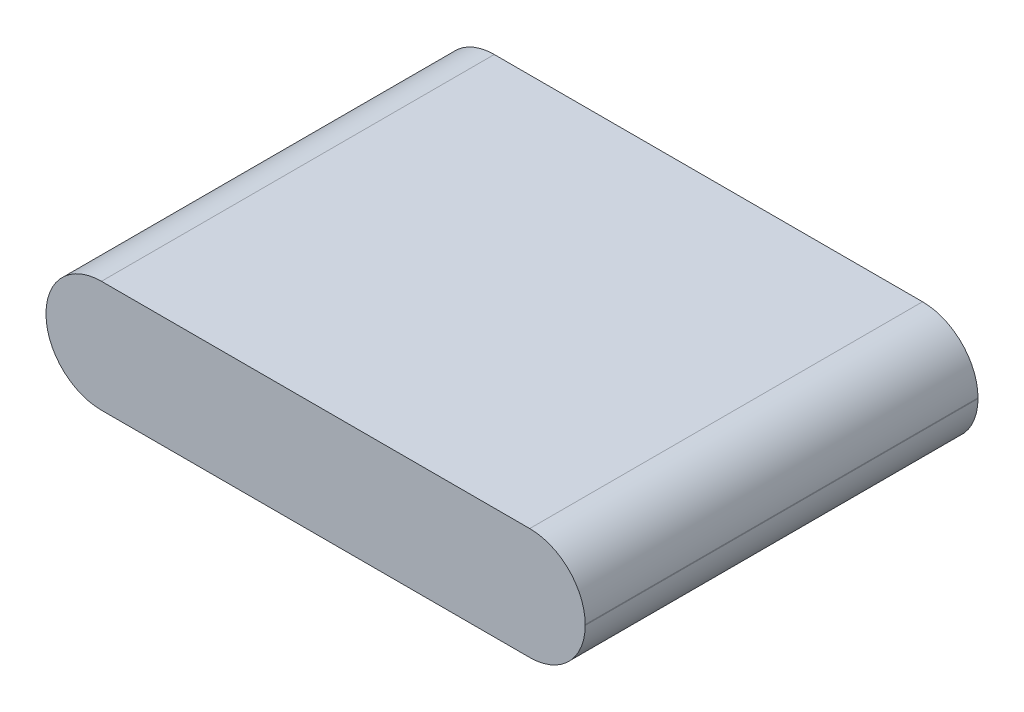
ISO-10303-21;
HEADER;
FILE_DESCRIPTION(('STEP AP214'),'2;1');
FILE_NAME('part.step','',(''),(''),'','','');
FILE_SCHEMA(('AUTOMOTIVE_DESIGN { 1 0 10303 214 1 1 1 1 }'));
ENDSEC;
DATA;
#1=APPLICATION_CONTEXT('core data for automotive mechanical design processes');
#2=APPLICATION_PROTOCOL_DEFINITION('international standard','automotive_design',2000,#1);
#3=PRODUCT_CONTEXT('',#1,'mechanical');
#4=PRODUCT('Part','Part','',(#3));
#5=PRODUCT_RELATED_PRODUCT_CATEGORY('part','',(#4));
#6=PRODUCT_DEFINITION_FORMATION('','',#4);
#7=PRODUCT_DEFINITION_CONTEXT('part definition',#1,'design');
#8=PRODUCT_DEFINITION('design','',#6,#7);
#9=PRODUCT_DEFINITION_SHAPE('','',#8);
#10=(LENGTH_UNIT() NAMED_UNIT(*) SI_UNIT(.MILLI.,.METRE.));
#11=(NAMED_UNIT(*) PLANE_ANGLE_UNIT() SI_UNIT($,.RADIAN.));
#12=(NAMED_UNIT(*) SI_UNIT($,.STERADIAN.) SOLID_ANGLE_UNIT());
#13=UNCERTAINTY_MEASURE_WITH_UNIT(LENGTH_MEASURE(1.E-05),#10,'distance_accuracy_value','');
#14=(GEOMETRIC_REPRESENTATION_CONTEXT(3) GLOBAL_UNCERTAINTY_ASSIGNED_CONTEXT((#13)) GLOBAL_UNIT_ASSIGNED_CONTEXT((#10,
#11,#12)) REPRESENTATION_CONTEXT('',''));
#15=CARTESIAN_POINT('',(0.,0.,0.));
#16=DIRECTION('',(0.,0.,1.));
#17=DIRECTION('',(1.,0.,0.));
#18=AXIS2_PLACEMENT_3D('',#15,#16,#17);
#19=CARTESIAN_POINT('',(35.,14.5,25.5));
#20=DIRECTION('',(-1.,0.,0.));
#21=DIRECTION('',(0.,0.,1.));
#22=AXIS2_PLACEMENT_3D('',#19,#20,#21);
#23=PLANE('',#22);
#24=DIRECTION('',(0.,-1.,0.));
#25=VECTOR('',#24,1.);
#26=CARTESIAN_POINT('',(35.,14.5,25.5));
#27=LINE('',#26,#25);
#28=CARTESIAN_POINT('',(35.,7.3,25.5));
#29=VERTEX_POINT('',#28);
#30=CARTESIAN_POINT('',(35.,7.2,25.5));
#31=VERTEX_POINT('',#30);
#32=EDGE_CURVE('E133',#29,#31,#27,.T.);
#33=ORIENTED_EDGE('',*,*,#32,.T.);
#34=DIRECTION('',(0.,0.,-1.));
#35=VECTOR('',#34,1.);
#36=CARTESIAN_POINT('',(35.,7.2,-25.5));
#37=LINE('',#36,#35);
#38=CARTESIAN_POINT('',(35.,7.2,-25.5));
#39=VERTEX_POINT('',#38);
#40=EDGE_CURVE('E11',#31,#39,#37,.T.);
#41=ORIENTED_EDGE('',*,*,#40,.T.);
#42=DIRECTION('',(0.,-1.,0.));
#43=VECTOR('',#42,1.);
#44=CARTESIAN_POINT('',(35.,14.5,-25.5));
#45=LINE('',#44,#43);
#46=CARTESIAN_POINT('',(35.,7.3,-25.5));
#47=VERTEX_POINT('',#46);
#48=EDGE_CURVE('E138',#47,#39,#45,.T.);
#49=ORIENTED_EDGE('',*,*,#48,.F.);
#50=DIRECTION('',(0.,0.,-1.));
#51=VECTOR('',#50,1.);
#52=CARTESIAN_POINT('',(35.,7.3,25.5));
#53=LINE('',#52,#51);
#54=EDGE_CURVE('E53',#47,#29,#53,.F.);
#55=ORIENTED_EDGE('',*,*,#54,.T.);
#56=EDGE_LOOP('',(#33,#41,#49,#55));
#57=FACE_BOUND('',#56,.T.);
#58=ADVANCED_FACE('F45',(#57),#23,.F.);
#59=CARTESIAN_POINT('',(-35.,14.5,-25.5));
#60=DIRECTION('',(0.,0.,1.));
#61=DIRECTION('',(1.,0.,0.));
#62=AXIS2_PLACEMENT_3D('',#59,#60,#61);
#63=PLANE('',#62);
#64=DIRECTION('',(-1.,0.,0.));
#65=VECTOR('',#64,1.);
#66=CARTESIAN_POINT('',(-35.,0.,-25.5));
#67=LINE('',#66,#65);
#68=CARTESIAN_POINT('',(27.8,0.,-25.5));
#69=VERTEX_POINT('',#68);
#70=CARTESIAN_POINT('',(-27.8,0.,-25.5));
#71=VERTEX_POINT('',#70);
#72=EDGE_CURVE('E180',#69,#71,#67,.T.);
#73=ORIENTED_EDGE('',*,*,#72,.T.);
#74=CARTESIAN_POINT('',(-27.8,7.2,-25.5));
#75=DIRECTION('',(0.,0.,1.));
#76=DIRECTION('',(1.,0.,0.));
#77=AXIS2_PLACEMENT_3D('',#74,#75,#76);
#78=CIRCLE('',#77,7.2);
#79=CARTESIAN_POINT('',(-35.,7.2,-25.5));
#80=VERTEX_POINT('',#79);
#81=EDGE_CURVE('E155',#71,#80,#78,.F.);
#82=ORIENTED_EDGE('',*,*,#81,.T.);
#83=DIRECTION('',(0.,-1.,0.));
#84=VECTOR('',#83,1.);
#85=CARTESIAN_POINT('',(-35.,14.5,-25.5));
#86=LINE('',#85,#84);
#87=CARTESIAN_POINT('',(-35.,7.3,-25.5));
#88=VERTEX_POINT('',#87);
#89=EDGE_CURVE('E132',#88,#80,#86,.T.);
#90=ORIENTED_EDGE('',*,*,#89,.F.);
#91=CARTESIAN_POINT('',(-27.8,7.3,-25.5));
#92=DIRECTION('',(0.,0.,1.));
#93=DIRECTION('',(1.,0.,0.));
#94=AXIS2_PLACEMENT_3D('',#91,#92,#93);
#95=CIRCLE('',#94,7.2);
#96=CARTESIAN_POINT('',(-27.8,14.5,-25.5));
#97=VERTEX_POINT('',#96);
#98=EDGE_CURVE('E137',#88,#97,#95,.F.);
#99=ORIENTED_EDGE('',*,*,#98,.T.);
#100=DIRECTION('',(-1.,0.,0.));
#101=VECTOR('',#100,1.);
#102=CARTESIAN_POINT('',(-35.,14.5,-25.5));
#103=LINE('',#102,#101);
#104=CARTESIAN_POINT('',(27.8,14.5,-25.5));
#105=VERTEX_POINT('',#104);
#106=EDGE_CURVE('E174',#105,#97,#103,.T.);
#107=ORIENTED_EDGE('',*,*,#106,.F.);
#108=CARTESIAN_POINT('',(27.8,7.3,-25.5));
#109=DIRECTION('',(0.,0.,1.));
#110=DIRECTION('',(1.,0.,0.));
#111=AXIS2_PLACEMENT_3D('',#108,#109,#110);
#112=CIRCLE('',#111,7.2);
#113=EDGE_CURVE('E67',#105,#47,#112,.F.);
#114=ORIENTED_EDGE('',*,*,#113,.T.);
#115=ORIENTED_EDGE('',*,*,#48,.T.);
#116=CARTESIAN_POINT('',(27.8,7.2,-25.5));
#117=DIRECTION('',(0.,0.,1.));
#118=DIRECTION('',(1.,0.,0.));
#119=AXIS2_PLACEMENT_3D('',#116,#117,#118);
#120=CIRCLE('',#119,7.2);
#121=EDGE_CURVE('E60',#39,#69,#120,.F.);
#122=ORIENTED_EDGE('',*,*,#121,.T.);
#123=EDGE_LOOP('',(#73,#82,#90,#99,#107,#114,#115,#122));
#124=FACE_BOUND('',#123,.T.);
#125=ADVANCED_FACE('F176',(#124),#63,.F.);
#126=CARTESIAN_POINT('',(-35.,14.5,25.5));
#127=DIRECTION('',(1.,0.,0.));
#128=DIRECTION('',(0.,0.,-1.));
#129=AXIS2_PLACEMENT_3D('',#126,#127,#128);
#130=PLANE('',#129);
#131=ORIENTED_EDGE('',*,*,#89,.T.);
#132=DIRECTION('',(0.,0.,1.));
#133=VECTOR('',#132,1.);
#134=CARTESIAN_POINT('',(-35.,7.2,25.5));
#135=LINE('',#134,#133);
#136=CARTESIAN_POINT('',(-35.,7.2,25.5));
#137=VERTEX_POINT('',#136);
#138=EDGE_CURVE('E131',#80,#137,#135,.T.);
#139=ORIENTED_EDGE('',*,*,#138,.T.);
#140=DIRECTION('',(0.,-1.,0.));
#141=VECTOR('',#140,1.);
#142=CARTESIAN_POINT('',(-35.,14.5,25.5));
#143=LINE('',#142,#141);
#144=CARTESIAN_POINT('',(-35.,7.3,25.5));
#145=VERTEX_POINT('',#144);
#146=EDGE_CURVE('E114',#145,#137,#143,.T.);
#147=ORIENTED_EDGE('',*,*,#146,.F.);
#148=DIRECTION('',(0.,0.,1.));
#149=VECTOR('',#148,1.);
#150=CARTESIAN_POINT('',(-35.,7.3,25.5));
#151=LINE('',#150,#149);
#152=EDGE_CURVE('E128',#145,#88,#151,.F.);
#153=ORIENTED_EDGE('',*,*,#152,.T.);
#154=EDGE_LOOP('',(#131,#139,#147,#153));
#155=FACE_BOUND('',#154,.T.);
#156=ADVANCED_FACE('F127',(#155),#130,.F.);
#157=CARTESIAN_POINT('',(-35.,14.5,25.5));
#158=DIRECTION('',(0.,0.,-1.));
#159=DIRECTION('',(-1.,0.,0.));
#160=AXIS2_PLACEMENT_3D('',#157,#158,#159);
#161=PLANE('',#160);
#162=ORIENTED_EDGE('',*,*,#146,.T.);
#163=CARTESIAN_POINT('',(-27.8,7.2,25.5));
#164=DIRECTION('',(0.,0.,-1.));
#165=DIRECTION('',(-1.,0.,0.));
#166=AXIS2_PLACEMENT_3D('',#163,#164,#165);
#167=CIRCLE('',#166,7.2);
#168=CARTESIAN_POINT('',(-27.8,0.,25.5));
#169=VERTEX_POINT('',#168);
#170=EDGE_CURVE('E121',#137,#169,#167,.F.);
#171=ORIENTED_EDGE('',*,*,#170,.T.);
#172=DIRECTION('',(1.,0.,0.));
#173=VECTOR('',#172,1.);
#174=CARTESIAN_POINT('',(-35.,0.,25.5));
#175=LINE('',#174,#173);
#176=CARTESIAN_POINT('',(27.8,0.,25.5));
#177=VERTEX_POINT('',#176);
#178=EDGE_CURVE('E177',#169,#177,#175,.T.);
#179=ORIENTED_EDGE('',*,*,#178,.T.);
#180=CARTESIAN_POINT('',(27.8,7.2,25.5));
#181=DIRECTION('',(0.,0.,-1.));
#182=DIRECTION('',(-1.,0.,0.));
#183=AXIS2_PLACEMENT_3D('',#180,#181,#182);
#184=CIRCLE('',#183,7.2);
#185=EDGE_CURVE('E122',#177,#31,#184,.F.);
#186=ORIENTED_EDGE('',*,*,#185,.T.);
#187=ORIENTED_EDGE('',*,*,#32,.F.);
#188=CARTESIAN_POINT('',(27.8,7.3,25.5));
#189=DIRECTION('',(0.,0.,-1.));
#190=DIRECTION('',(-1.,0.,0.));
#191=AXIS2_PLACEMENT_3D('',#188,#189,#190);
#192=CIRCLE('',#191,7.2);
#193=CARTESIAN_POINT('',(27.8,14.5,25.5));
#194=VERTEX_POINT('',#193);
#195=EDGE_CURVE('E140',#29,#194,#192,.F.);
#196=ORIENTED_EDGE('',*,*,#195,.T.);
#197=DIRECTION('',(1.,0.,0.));
#198=VECTOR('',#197,1.);
#199=CARTESIAN_POINT('',(-35.,14.5,25.5));
#200=LINE('',#199,#198);
#201=CARTESIAN_POINT('',(-27.8,14.5,25.5));
#202=VERTEX_POINT('',#201);
#203=EDGE_CURVE('E116',#202,#194,#200,.T.);
#204=ORIENTED_EDGE('',*,*,#203,.F.);
#205=CARTESIAN_POINT('',(-27.8,7.3,25.5));
#206=DIRECTION('',(0.,0.,-1.));
#207=DIRECTION('',(-1.,0.,0.));
#208=AXIS2_PLACEMENT_3D('',#205,#206,#207);
#209=CIRCLE('',#208,7.2);
#210=EDGE_CURVE('E111',#202,#145,#209,.F.);
#211=ORIENTED_EDGE('',*,*,#210,.T.);
#212=EDGE_LOOP('',(#162,#171,#179,#186,#187,#196,#204,#211));
#213=FACE_BOUND('',#212,.T.);
#214=ADVANCED_FACE('F113',(#213),#161,.F.);
#215=CARTESIAN_POINT('',(0.,14.5,0.));
#216=DIRECTION('',(0.,-1.,0.));
#217=DIRECTION('',(0.,0.,-1.));
#218=AXIS2_PLACEMENT_3D('',#215,#216,#217);
#219=PLANE('',#218);
#220=ORIENTED_EDGE('',*,*,#106,.T.);
#221=DIRECTION('',(0.,0.,1.));
#222=VECTOR('',#221,1.);
#223=CARTESIAN_POINT('',(-27.8,14.5,0.));
#224=LINE('',#223,#222);
#225=EDGE_CURVE('E160',#97,#202,#224,.T.);
#226=ORIENTED_EDGE('',*,*,#225,.T.);
#227=ORIENTED_EDGE('',*,*,#203,.T.);
#228=DIRECTION('',(0.,0.,-1.));
#229=VECTOR('',#228,1.);
#230=CARTESIAN_POINT('',(27.8,14.5,0.));
#231=LINE('',#230,#229);
#232=EDGE_CURVE('E157',#194,#105,#231,.T.);
#233=ORIENTED_EDGE('',*,*,#232,.T.);
#234=EDGE_LOOP('',(#220,#226,#227,#233));
#235=FACE_BOUND('',#234,.T.);
#236=ADVANCED_FACE('F173',(#235),#219,.F.);
#237=CARTESIAN_POINT('',(0.,0.,0.));
#238=DIRECTION('',(0.,-1.,0.));
#239=DIRECTION('',(0.,0.,-1.));
#240=AXIS2_PLACEMENT_3D('',#237,#238,#239);
#241=PLANE('',#240);
#242=ORIENTED_EDGE('',*,*,#178,.F.);
#243=DIRECTION('',(0.,0.,1.));
#244=VECTOR('',#243,1.);
#245=CARTESIAN_POINT('',(-27.8,0.,-25.5));
#246=LINE('',#245,#244);
#247=EDGE_CURVE('E150',#169,#71,#246,.F.);
#248=ORIENTED_EDGE('',*,*,#247,.T.);
#249=ORIENTED_EDGE('',*,*,#72,.F.);
#250=DIRECTION('',(0.,0.,-1.));
#251=VECTOR('',#250,1.);
#252=CARTESIAN_POINT('',(27.8,0.,25.5));
#253=LINE('',#252,#251);
#254=EDGE_CURVE('E148',#69,#177,#253,.F.);
#255=ORIENTED_EDGE('',*,*,#254,.T.);
#256=EDGE_LOOP('',(#242,#248,#249,#255));
#257=FACE_BOUND('',#256,.T.);
#258=ADVANCED_FACE('F189',(#257),#241,.T.);
#259=CARTESIAN_POINT('',(-27.8,7.2,25.5));
#260=DIRECTION('',(0.,0.,-1.));
#261=DIRECTION('',(-1.,0.,0.));
#262=AXIS2_PLACEMENT_3D('',#259,#260,#261);
#263=CYLINDRICAL_SURFACE('',#262,7.2);
#264=ORIENTED_EDGE('',*,*,#81,.F.);
#265=ORIENTED_EDGE('',*,*,#247,.F.);
#266=ORIENTED_EDGE('',*,*,#170,.F.);
#267=ORIENTED_EDGE('',*,*,#138,.F.);
#268=EDGE_LOOP('',(#264,#265,#266,#267));
#269=FACE_BOUND('',#268,.T.);
#270=ADVANCED_FACE('F185',(#269),#263,.T.);
#271=CARTESIAN_POINT('',(-27.8,7.3,0.));
#272=DIRECTION('',(0.,0.,1.));
#273=DIRECTION('',(1.,0.,0.));
#274=AXIS2_PLACEMENT_3D('',#271,#272,#273);
#275=CYLINDRICAL_SURFACE('',#274,7.2);
#276=ORIENTED_EDGE('',*,*,#98,.F.);
#277=ORIENTED_EDGE('',*,*,#152,.F.);
#278=ORIENTED_EDGE('',*,*,#210,.F.);
#279=ORIENTED_EDGE('',*,*,#225,.F.);
#280=EDGE_LOOP('',(#276,#277,#278,#279));
#281=FACE_BOUND('',#280,.T.);
#282=ADVANCED_FACE('F136',(#281),#275,.T.);
#283=CARTESIAN_POINT('',(27.8,7.2,25.5));
#284=DIRECTION('',(0.,0.,1.));
#285=DIRECTION('',(1.,0.,0.));
#286=AXIS2_PLACEMENT_3D('',#283,#284,#285);
#287=CYLINDRICAL_SURFACE('',#286,7.2);
#288=ORIENTED_EDGE('',*,*,#185,.F.);
#289=ORIENTED_EDGE('',*,*,#254,.F.);
#290=ORIENTED_EDGE('',*,*,#121,.F.);
#291=ORIENTED_EDGE('',*,*,#40,.F.);
#292=EDGE_LOOP('',(#288,#289,#290,#291));
#293=FACE_BOUND('',#292,.T.);
#294=ADVANCED_FACE('F191',(#293),#287,.T.);
#295=CARTESIAN_POINT('',(27.8,7.3,0.));
#296=DIRECTION('',(0.,0.,-1.));
#297=DIRECTION('',(-1.,0.,0.));
#298=AXIS2_PLACEMENT_3D('',#295,#296,#297);
#299=CYLINDRICAL_SURFACE('',#298,7.2);
#300=ORIENTED_EDGE('',*,*,#195,.F.);
#301=ORIENTED_EDGE('',*,*,#54,.F.);
#302=ORIENTED_EDGE('',*,*,#113,.F.);
#303=ORIENTED_EDGE('',*,*,#232,.F.);
#304=EDGE_LOOP('',(#300,#301,#302,#303));
#305=FACE_BOUND('',#304,.T.);
#306=ADVANCED_FACE('F47',(#305),#299,.T.);
#307=CLOSED_SHELL('',(#58,#125,#156,#214,#236,#258,#270,#282,#294,#306));
#308=MANIFOLD_SOLID_BREP('B2',#307);
#309=ADVANCED_BREP_SHAPE_REPRESENTATION('',(#18,#308),#14);
#310=SHAPE_DEFINITION_REPRESENTATION(#9,#309);
ENDSEC;
END-ISO-10303-21;
